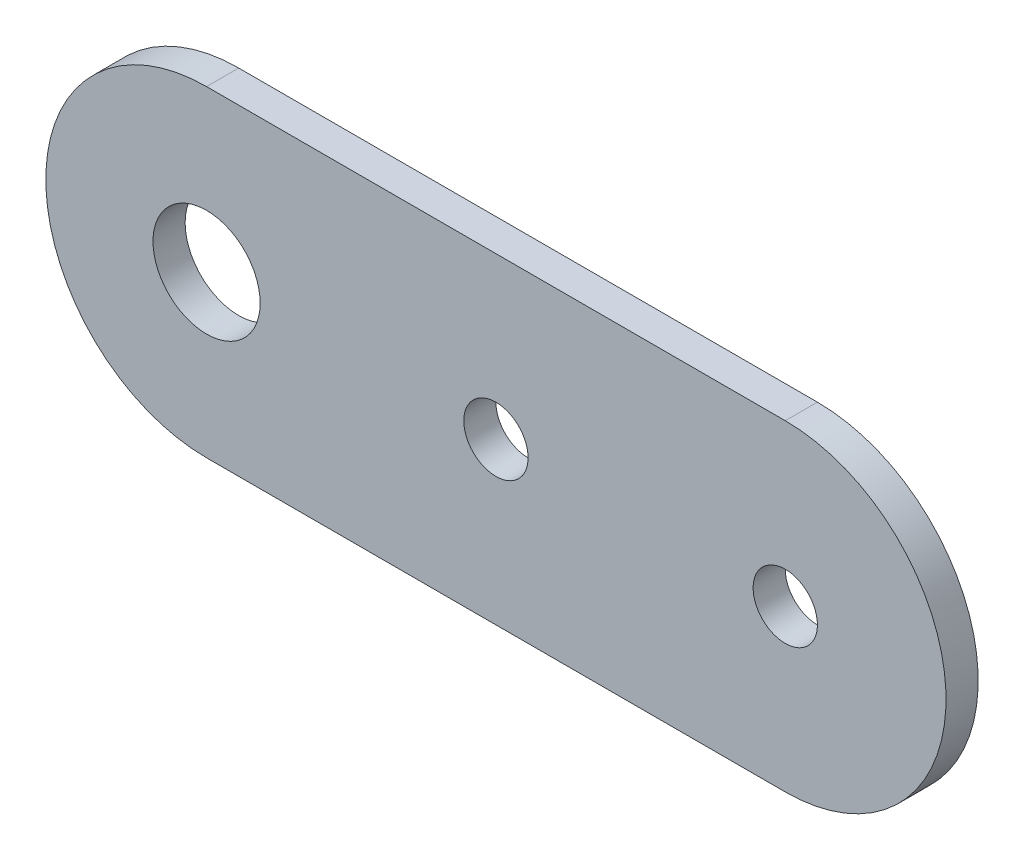
ISO-10303-21;
HEADER;
FILE_DESCRIPTION(('STEP AP214'),'2;1');
FILE_NAME('part.step','',(''),(''),'','','');
FILE_SCHEMA(('AUTOMOTIVE_DESIGN { 1 0 10303 214 1 1 1 1 }'));
ENDSEC;
DATA;
#1=APPLICATION_CONTEXT('core data for automotive mechanical design processes');
#2=APPLICATION_PROTOCOL_DEFINITION('international standard','automotive_design',2000,#1);
#3=PRODUCT_CONTEXT('',#1,'mechanical');
#4=PRODUCT('Part','Part','',(#3));
#5=PRODUCT_RELATED_PRODUCT_CATEGORY('part','',(#4));
#6=PRODUCT_DEFINITION_FORMATION('','',#4);
#7=PRODUCT_DEFINITION_CONTEXT('part definition',#1,'design');
#8=PRODUCT_DEFINITION('design','',#6,#7);
#9=PRODUCT_DEFINITION_SHAPE('','',#8);
#10=(LENGTH_UNIT() NAMED_UNIT(*) SI_UNIT(.MILLI.,.METRE.));
#11=(NAMED_UNIT(*) PLANE_ANGLE_UNIT() SI_UNIT($,.RADIAN.));
#12=(NAMED_UNIT(*) SI_UNIT($,.STERADIAN.) SOLID_ANGLE_UNIT());
#13=UNCERTAINTY_MEASURE_WITH_UNIT(LENGTH_MEASURE(1.E-05),#10,'distance_accuracy_value','');
#14=(GEOMETRIC_REPRESENTATION_CONTEXT(3) GLOBAL_UNCERTAINTY_ASSIGNED_CONTEXT((#13)) GLOBAL_UNIT_ASSIGNED_CONTEXT((#10,
#11,#12)) REPRESENTATION_CONTEXT('',''));
#15=CARTESIAN_POINT('',(0.,0.,0.));
#16=DIRECTION('',(0.,0.,1.));
#17=DIRECTION('',(1.,0.,0.));
#18=AXIS2_PLACEMENT_3D('',#15,#16,#17);
#19=CARTESIAN_POINT('',(54.,0.,3.));
#20=DIRECTION('',(0.,0.,-1.));
#21=DIRECTION('',(-1.,0.,0.));
#22=AXIS2_PLACEMENT_3D('',#19,#20,#21);
#23=CYLINDRICAL_SURFACE('',#22,15.);
#24=CARTESIAN_POINT('',(54.,0.,0.));
#25=DIRECTION('',(0.,0.,1.));
#26=DIRECTION('',(-1.,0.,0.));
#27=AXIS2_PLACEMENT_3D('',#24,#25,#26);
#28=CIRCLE('',#27,15.);
#29=CARTESIAN_POINT('',(54.,-15.,0.));
#30=VERTEX_POINT('',#29);
#31=CARTESIAN_POINT('',(54.,15.,0.));
#32=VERTEX_POINT('',#31);
#33=EDGE_CURVE('E107',#30,#32,#28,.T.);
#34=ORIENTED_EDGE('',*,*,#33,.T.);
#35=DIRECTION('',(0.,0.,-1.));
#36=VECTOR('',#35,1.);
#37=CARTESIAN_POINT('',(54.,15.,3.));
#38=LINE('',#37,#36);
#39=CARTESIAN_POINT('',(54.,15.,3.));
#40=VERTEX_POINT('',#39);
#41=EDGE_CURVE('E11',#40,#32,#38,.T.);
#42=ORIENTED_EDGE('',*,*,#41,.F.);
#43=CARTESIAN_POINT('',(54.,0.,3.));
#44=DIRECTION('',(0.,0.,1.));
#45=DIRECTION('',(-1.,0.,0.));
#46=AXIS2_PLACEMENT_3D('',#43,#44,#45);
#47=CIRCLE('',#46,15.);
#48=CARTESIAN_POINT('',(54.,-15.,3.));
#49=VERTEX_POINT('',#48);
#50=EDGE_CURVE('E91',#49,#40,#47,.T.);
#51=ORIENTED_EDGE('',*,*,#50,.F.);
#52=DIRECTION('',(0.,0.,-1.));
#53=VECTOR('',#52,1.);
#54=CARTESIAN_POINT('',(54.,-15.,3.));
#55=LINE('',#54,#53);
#56=EDGE_CURVE('E103',#49,#30,#55,.T.);
#57=ORIENTED_EDGE('',*,*,#56,.T.);
#58=EDGE_LOOP('',(#34,#42,#51,#57));
#59=FACE_BOUND('',#58,.T.);
#60=ADVANCED_FACE('F39',(#59),#23,.T.);
#61=CARTESIAN_POINT('',(0.,15.,3.));
#62=DIRECTION('',(0.,-1.,0.));
#63=DIRECTION('',(0.,0.,-1.));
#64=AXIS2_PLACEMENT_3D('',#61,#62,#63);
#65=PLANE('',#64);
#66=DIRECTION('',(-1.,0.,0.));
#67=VECTOR('',#66,1.);
#68=CARTESIAN_POINT('',(0.,15.,0.));
#69=LINE('',#68,#67);
#70=CARTESIAN_POINT('',(0.,15.,0.));
#71=VERTEX_POINT('',#70);
#72=EDGE_CURVE('E96',#32,#71,#69,.T.);
#73=ORIENTED_EDGE('',*,*,#72,.T.);
#74=DIRECTION('',(0.,0.,-1.));
#75=VECTOR('',#74,1.);
#76=CARTESIAN_POINT('',(0.,15.,3.));
#77=LINE('',#76,#75);
#78=CARTESIAN_POINT('',(0.,15.,3.));
#79=VERTEX_POINT('',#78);
#80=EDGE_CURVE('E48',#79,#71,#77,.T.);
#81=ORIENTED_EDGE('',*,*,#80,.F.);
#82=DIRECTION('',(-1.,0.,0.));
#83=VECTOR('',#82,1.);
#84=CARTESIAN_POINT('',(0.,15.,3.));
#85=LINE('',#84,#83);
#86=EDGE_CURVE('E86',#40,#79,#85,.T.);
#87=ORIENTED_EDGE('',*,*,#86,.F.);
#88=ORIENTED_EDGE('',*,*,#41,.T.);
#89=EDGE_LOOP('',(#73,#81,#87,#88));
#90=FACE_BOUND('',#89,.T.);
#91=ADVANCED_FACE('F95',(#90),#65,.F.);
#92=CARTESIAN_POINT('',(0.,0.,3.));
#93=DIRECTION('',(0.,0.,-1.));
#94=DIRECTION('',(-1.,0.,0.));
#95=AXIS2_PLACEMENT_3D('',#92,#93,#94);
#96=CYLINDRICAL_SURFACE('',#95,15.);
#97=CARTESIAN_POINT('',(0.,0.,0.));
#98=DIRECTION('',(0.,0.,1.));
#99=DIRECTION('',(-1.,0.,0.));
#100=AXIS2_PLACEMENT_3D('',#97,#98,#99);
#101=CIRCLE('',#100,15.);
#102=CARTESIAN_POINT('',(0.,-15.,0.));
#103=VERTEX_POINT('',#102);
#104=EDGE_CURVE('E73',#71,#103,#101,.T.);
#105=ORIENTED_EDGE('',*,*,#104,.T.);
#106=DIRECTION('',(0.,0.,-1.));
#107=VECTOR('',#106,1.);
#108=CARTESIAN_POINT('',(0.,-15.,3.));
#109=LINE('',#108,#107);
#110=CARTESIAN_POINT('',(0.,-15.,3.));
#111=VERTEX_POINT('',#110);
#112=EDGE_CURVE('E98',#111,#103,#109,.T.);
#113=ORIENTED_EDGE('',*,*,#112,.F.);
#114=CARTESIAN_POINT('',(0.,0.,3.));
#115=DIRECTION('',(0.,0.,1.));
#116=DIRECTION('',(-1.,0.,0.));
#117=AXIS2_PLACEMENT_3D('',#114,#115,#116);
#118=CIRCLE('',#117,15.);
#119=EDGE_CURVE('E89',#79,#111,#118,.T.);
#120=ORIENTED_EDGE('',*,*,#119,.F.);
#121=ORIENTED_EDGE('',*,*,#80,.T.);
#122=EDGE_LOOP('',(#105,#113,#120,#121));
#123=FACE_BOUND('',#122,.T.);
#124=ADVANCED_FACE('F99',(#123),#96,.T.);
#125=CARTESIAN_POINT('',(54.,-15.,3.));
#126=DIRECTION('',(0.,1.,0.));
#127=DIRECTION('',(0.,0.,1.));
#128=AXIS2_PLACEMENT_3D('',#125,#126,#127);
#129=PLANE('',#128);
#130=DIRECTION('',(1.,0.,0.));
#131=VECTOR('',#130,1.);
#132=CARTESIAN_POINT('',(54.,-15.,0.));
#133=LINE('',#132,#131);
#134=EDGE_CURVE('E79',#103,#30,#133,.T.);
#135=ORIENTED_EDGE('',*,*,#134,.T.);
#136=ORIENTED_EDGE('',*,*,#56,.F.);
#137=DIRECTION('',(1.,0.,0.));
#138=VECTOR('',#137,1.);
#139=CARTESIAN_POINT('',(54.,-15.,3.));
#140=LINE('',#139,#138);
#141=EDGE_CURVE('E56',#111,#49,#140,.T.);
#142=ORIENTED_EDGE('',*,*,#141,.F.);
#143=ORIENTED_EDGE('',*,*,#112,.T.);
#144=EDGE_LOOP('',(#135,#136,#142,#143));
#145=FACE_BOUND('',#144,.T.);
#146=ADVANCED_FACE('F121',(#145),#129,.F.);
#147=CARTESIAN_POINT('',(54.,0.,3.));
#148=DIRECTION('',(0.,0.,-1.));
#149=DIRECTION('',(-1.,0.,0.));
#150=AXIS2_PLACEMENT_3D('',#147,#148,#149);
#151=PLANE('',#150);
#152=CARTESIAN_POINT('',(0.,0.,3.));
#153=DIRECTION('',(0.,0.,1.));
#154=DIRECTION('',(1.,0.,0.));
#155=AXIS2_PLACEMENT_3D('',#152,#153,#154);
#156=CIRCLE('',#155,5.);
#157=CARTESIAN_POINT('',(5.,0.,3.));
#158=VERTEX_POINT('',#157);
#159=EDGE_CURVE('E141',#158,#158,#156,.T.);
#160=ORIENTED_EDGE('',*,*,#159,.F.);
#161=EDGE_LOOP('',(#160));
#162=FACE_BOUND('',#161,.T.);
#163=CARTESIAN_POINT('',(27.,0.,3.));
#164=DIRECTION('',(0.,0.,1.));
#165=DIRECTION('',(1.,0.,0.));
#166=AXIS2_PLACEMENT_3D('',#163,#164,#165);
#167=CIRCLE('',#166,3.);
#168=CARTESIAN_POINT('',(30.,0.,3.));
#169=VERTEX_POINT('',#168);
#170=EDGE_CURVE('E132',#169,#169,#167,.T.);
#171=ORIENTED_EDGE('',*,*,#170,.F.);
#172=EDGE_LOOP('',(#171));
#173=FACE_BOUND('',#172,.T.);
#174=CARTESIAN_POINT('',(54.,0.,3.));
#175=DIRECTION('',(0.,0.,1.));
#176=DIRECTION('',(1.,0.,0.));
#177=AXIS2_PLACEMENT_3D('',#174,#175,#176);
#178=CIRCLE('',#177,3.00000000000001);
#179=CARTESIAN_POINT('',(57.,0.,3.));
#180=VERTEX_POINT('',#179);
#181=EDGE_CURVE('E133',#180,#180,#178,.T.);
#182=ORIENTED_EDGE('',*,*,#181,.F.);
#183=EDGE_LOOP('',(#182));
#184=FACE_BOUND('',#183,.T.);
#185=ORIENTED_EDGE('',*,*,#50,.T.);
#186=ORIENTED_EDGE('',*,*,#86,.T.);
#187=ORIENTED_EDGE('',*,*,#119,.T.);
#188=ORIENTED_EDGE('',*,*,#141,.T.);
#189=EDGE_LOOP('',(#185,#186,#187,#188));
#190=FACE_BOUND('',#189,.T.);
#191=ADVANCED_FACE('F87',(#162,#173,#184,#190),#151,.F.);
#192=CARTESIAN_POINT('',(54.,0.,0.));
#193=DIRECTION('',(0.,0.,-1.));
#194=DIRECTION('',(-1.,0.,0.));
#195=AXIS2_PLACEMENT_3D('',#192,#193,#194);
#196=PLANE('',#195);
#197=CARTESIAN_POINT('',(0.,0.,0.));
#198=DIRECTION('',(0.,0.,-1.));
#199=DIRECTION('',(-1.,0.,0.));
#200=AXIS2_PLACEMENT_3D('',#197,#198,#199);
#201=CIRCLE('',#200,5.);
#202=CARTESIAN_POINT('',(-5.,0.,0.));
#203=VERTEX_POINT('',#202);
#204=EDGE_CURVE('E111',#203,#203,#201,.F.);
#205=ORIENTED_EDGE('',*,*,#204,.T.);
#206=EDGE_LOOP('',(#205));
#207=FACE_BOUND('',#206,.T.);
#208=CARTESIAN_POINT('',(27.,0.,0.));
#209=DIRECTION('',(0.,0.,-1.));
#210=DIRECTION('',(-1.,0.,0.));
#211=AXIS2_PLACEMENT_3D('',#208,#209,#210);
#212=CIRCLE('',#211,3.);
#213=CARTESIAN_POINT('',(24.,0.,0.));
#214=VERTEX_POINT('',#213);
#215=EDGE_CURVE('E137',#214,#214,#212,.F.);
#216=ORIENTED_EDGE('',*,*,#215,.T.);
#217=EDGE_LOOP('',(#216));
#218=FACE_BOUND('',#217,.T.);
#219=CARTESIAN_POINT('',(54.,0.,0.));
#220=DIRECTION('',(0.,0.,-1.));
#221=DIRECTION('',(-1.,0.,0.));
#222=AXIS2_PLACEMENT_3D('',#219,#220,#221);
#223=CIRCLE('',#222,3.00000000000001);
#224=CARTESIAN_POINT('',(51.,0.,0.));
#225=VERTEX_POINT('',#224);
#226=EDGE_CURVE('E128',#225,#225,#223,.F.);
#227=ORIENTED_EDGE('',*,*,#226,.T.);
#228=EDGE_LOOP('',(#227));
#229=FACE_BOUND('',#228,.T.);
#230=ORIENTED_EDGE('',*,*,#33,.F.);
#231=ORIENTED_EDGE('',*,*,#134,.F.);
#232=ORIENTED_EDGE('',*,*,#104,.F.);
#233=ORIENTED_EDGE('',*,*,#72,.F.);
#234=EDGE_LOOP('',(#230,#231,#232,#233));
#235=FACE_BOUND('',#234,.T.);
#236=ADVANCED_FACE('F124',(#207,#218,#229,#235),#196,.T.);
#237=CARTESIAN_POINT('',(54.,0.,-14.142135623731));
#238=DIRECTION('',(0.,0.,1.));
#239=DIRECTION('',(1.,0.,0.));
#240=AXIS2_PLACEMENT_3D('',#237,#238,#239);
#241=CYLINDRICAL_SURFACE('',#240,3.00000000000001);
#242=ORIENTED_EDGE('',*,*,#181,.T.);
#243=EDGE_LOOP('',(#242));
#244=FACE_BOUND('',#243,.T.);
#245=ORIENTED_EDGE('',*,*,#226,.F.);
#246=EDGE_LOOP('',(#245));
#247=FACE_BOUND('',#246,.T.);
#248=ADVANCED_FACE('F162',(#244,#247),#241,.F.);
#249=CARTESIAN_POINT('',(27.,0.,-14.142135623731));
#250=DIRECTION('',(0.,0.,1.));
#251=DIRECTION('',(1.,0.,0.));
#252=AXIS2_PLACEMENT_3D('',#249,#250,#251);
#253=CYLINDRICAL_SURFACE('',#252,3.);
#254=ORIENTED_EDGE('',*,*,#170,.T.);
#255=EDGE_LOOP('',(#254));
#256=FACE_BOUND('',#255,.T.);
#257=ORIENTED_EDGE('',*,*,#215,.F.);
#258=EDGE_LOOP('',(#257));
#259=FACE_BOUND('',#258,.T.);
#260=ADVANCED_FACE('F165',(#256,#259),#253,.F.);
#261=CARTESIAN_POINT('',(0.,0.,-14.142135623731));
#262=DIRECTION('',(0.,0.,1.));
#263=DIRECTION('',(1.,0.,0.));
#264=AXIS2_PLACEMENT_3D('',#261,#262,#263);
#265=CYLINDRICAL_SURFACE('',#264,5.);
#266=ORIENTED_EDGE('',*,*,#159,.T.);
#267=EDGE_LOOP('',(#266));
#268=FACE_BOUND('',#267,.T.);
#269=ORIENTED_EDGE('',*,*,#204,.F.);
#270=EDGE_LOOP('',(#269));
#271=FACE_BOUND('',#270,.T.);
#272=ADVANCED_FACE('F152',(#268,#271),#265,.F.);
#273=CLOSED_SHELL('',(#60,#91,#124,#146,#191,#236,#248,#260,#272));
#274=MANIFOLD_SOLID_BREP('B2',#273);
#275=ADVANCED_BREP_SHAPE_REPRESENTATION('',(#18,#274),#14);
#276=SHAPE_DEFINITION_REPRESENTATION(#9,#275);
ENDSEC;
END-ISO-10303-21;
